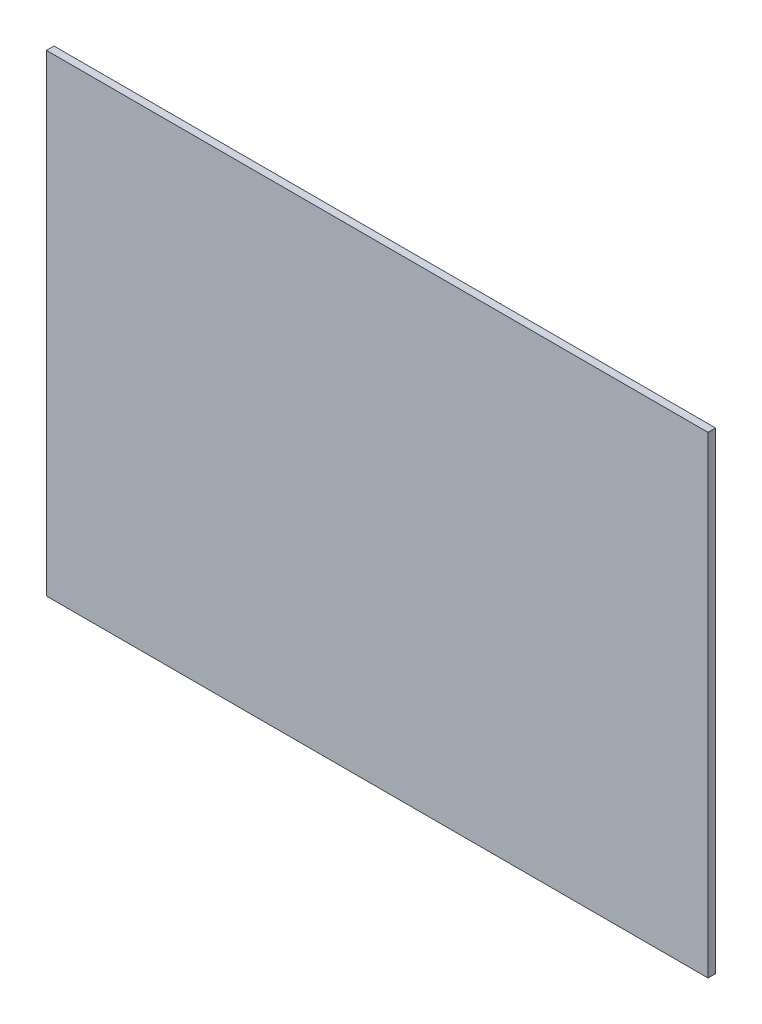
ISO-10303-21;
HEADER;
FILE_DESCRIPTION(('STEP AP214'),'2;1');
FILE_NAME('part.step','',(''),(''),'','','');
FILE_SCHEMA(('AUTOMOTIVE_DESIGN { 1 0 10303 214 1 1 1 1 }'));
ENDSEC;
DATA;
#1=APPLICATION_CONTEXT('core data for automotive mechanical design processes');
#2=APPLICATION_PROTOCOL_DEFINITION('international standard','automotive_design',2000,#1);
#3=PRODUCT_CONTEXT('',#1,'mechanical');
#4=PRODUCT('Part','Part','',(#3));
#5=PRODUCT_RELATED_PRODUCT_CATEGORY('part','',(#4));
#6=PRODUCT_DEFINITION_FORMATION('','',#4);
#7=PRODUCT_DEFINITION_CONTEXT('part definition',#1,'design');
#8=PRODUCT_DEFINITION('design','',#6,#7);
#9=PRODUCT_DEFINITION_SHAPE('','',#8);
#10=(LENGTH_UNIT() NAMED_UNIT(*) SI_UNIT(.MILLI.,.METRE.));
#11=(NAMED_UNIT(*) PLANE_ANGLE_UNIT() SI_UNIT($,.RADIAN.));
#12=(NAMED_UNIT(*) SI_UNIT($,.STERADIAN.) SOLID_ANGLE_UNIT());
#13=UNCERTAINTY_MEASURE_WITH_UNIT(LENGTH_MEASURE(1.E-05),#10,'distance_accuracy_value','');
#14=(GEOMETRIC_REPRESENTATION_CONTEXT(3) GLOBAL_UNCERTAINTY_ASSIGNED_CONTEXT((#13)) GLOBAL_UNIT_ASSIGNED_CONTEXT((#10,
#11,#12)) REPRESENTATION_CONTEXT('',''));
#15=CARTESIAN_POINT('',(0.,0.,0.));
#16=DIRECTION('',(0.,0.,1.));
#17=DIRECTION('',(1.,0.,0.));
#18=AXIS2_PLACEMENT_3D('',#15,#16,#17);
#19=CARTESIAN_POINT('',(700.,500.,8.));
#20=DIRECTION('',(-1.,0.,0.));
#21=DIRECTION('',(0.,-1.,0.));
#22=AXIS2_PLACEMENT_3D('',#19,#20,#21);
#23=PLANE('',#22);
#24=DIRECTION('',(0.,1.,0.));
#25=VECTOR('',#24,1.);
#26=CARTESIAN_POINT('',(700.,500.,0.));
#27=LINE('',#26,#25);
#28=CARTESIAN_POINT('',(700.,0.,0.));
#29=VERTEX_POINT('',#28);
#30=CARTESIAN_POINT('',(700.,500.,0.));
#31=VERTEX_POINT('',#30);
#32=EDGE_CURVE('E109',#29,#31,#27,.T.);
#33=ORIENTED_EDGE('',*,*,#32,.T.);
#34=DIRECTION('',(0.,0.,-1.));
#35=VECTOR('',#34,1.);
#36=CARTESIAN_POINT('',(700.,500.,8.));
#37=LINE('',#36,#35);
#38=CARTESIAN_POINT('',(700.,500.,8.));
#39=VERTEX_POINT('',#38);
#40=EDGE_CURVE('E11',#39,#31,#37,.T.);
#41=ORIENTED_EDGE('',*,*,#40,.F.);
#42=DIRECTION('',(0.,1.,0.));
#43=VECTOR('',#42,1.);
#44=CARTESIAN_POINT('',(700.,500.,8.));
#45=LINE('',#44,#43);
#46=CARTESIAN_POINT('',(700.,0.,8.));
#47=VERTEX_POINT('',#46);
#48=EDGE_CURVE('E93',#47,#39,#45,.T.);
#49=ORIENTED_EDGE('',*,*,#48,.F.);
#50=DIRECTION('',(0.,0.,-1.));
#51=VECTOR('',#50,1.);
#52=CARTESIAN_POINT('',(700.,0.,8.));
#53=LINE('',#52,#51);
#54=EDGE_CURVE('E105',#47,#29,#53,.T.);
#55=ORIENTED_EDGE('',*,*,#54,.T.);
#56=EDGE_LOOP('',(#33,#41,#49,#55));
#57=FACE_BOUND('',#56,.T.);
#58=ADVANCED_FACE('F41',(#57),#23,.F.);
#59=CARTESIAN_POINT('',(700.,500.,8.));
#60=DIRECTION('',(0.,-1.,0.));
#61=DIRECTION('',(1.,0.,0.));
#62=AXIS2_PLACEMENT_3D('',#59,#60,#61);
#63=PLANE('',#62);
#64=DIRECTION('',(-1.,0.,0.));
#65=VECTOR('',#64,1.);
#66=CARTESIAN_POINT('',(700.,500.,0.));
#67=LINE('',#66,#65);
#68=CARTESIAN_POINT('',(0.,500.,0.));
#69=VERTEX_POINT('',#68);
#70=EDGE_CURVE('E98',#31,#69,#67,.T.);
#71=ORIENTED_EDGE('',*,*,#70,.T.);
#72=DIRECTION('',(0.,0.,-1.));
#73=VECTOR('',#72,1.);
#74=CARTESIAN_POINT('',(0.,500.,8.));
#75=LINE('',#74,#73);
#76=CARTESIAN_POINT('',(0.,500.,8.));
#77=VERTEX_POINT('',#76);
#78=EDGE_CURVE('E50',#77,#69,#75,.T.);
#79=ORIENTED_EDGE('',*,*,#78,.F.);
#80=DIRECTION('',(-1.,0.,0.));
#81=VECTOR('',#80,1.);
#82=CARTESIAN_POINT('',(700.,500.,8.));
#83=LINE('',#82,#81);
#84=EDGE_CURVE('E88',#39,#77,#83,.T.);
#85=ORIENTED_EDGE('',*,*,#84,.F.);
#86=ORIENTED_EDGE('',*,*,#40,.T.);
#87=EDGE_LOOP('',(#71,#79,#85,#86));
#88=FACE_BOUND('',#87,.T.);
#89=ADVANCED_FACE('F97',(#88),#63,.F.);
#90=CARTESIAN_POINT('',(0.,500.,8.));
#91=DIRECTION('',(1.,0.,0.));
#92=DIRECTION('',(0.,1.,0.));
#93=AXIS2_PLACEMENT_3D('',#90,#91,#92);
#94=PLANE('',#93);
#95=DIRECTION('',(0.,-1.,0.));
#96=VECTOR('',#95,1.);
#97=CARTESIAN_POINT('',(0.,500.,0.));
#98=LINE('',#97,#96);
#99=CARTESIAN_POINT('',(0.,0.,0.));
#100=VERTEX_POINT('',#99);
#101=EDGE_CURVE('E75',#69,#100,#98,.T.);
#102=ORIENTED_EDGE('',*,*,#101,.T.);
#103=DIRECTION('',(0.,0.,-1.));
#104=VECTOR('',#103,1.);
#105=CARTESIAN_POINT('',(0.,0.,8.));
#106=LINE('',#105,#104);
#107=CARTESIAN_POINT('',(0.,0.,8.));
#108=VERTEX_POINT('',#107);
#109=EDGE_CURVE('E100',#108,#100,#106,.T.);
#110=ORIENTED_EDGE('',*,*,#109,.F.);
#111=DIRECTION('',(0.,-1.,0.));
#112=VECTOR('',#111,1.);
#113=CARTESIAN_POINT('',(0.,500.,8.));
#114=LINE('',#113,#112);
#115=EDGE_CURVE('E91',#77,#108,#114,.T.);
#116=ORIENTED_EDGE('',*,*,#115,.F.);
#117=ORIENTED_EDGE('',*,*,#78,.T.);
#118=EDGE_LOOP('',(#102,#110,#116,#117));
#119=FACE_BOUND('',#118,.T.);
#120=ADVANCED_FACE('F101',(#119),#94,.F.);
#121=CARTESIAN_POINT('',(700.,0.,8.));
#122=DIRECTION('',(0.,1.,0.));
#123=DIRECTION('',(-1.,0.,0.));
#124=AXIS2_PLACEMENT_3D('',#121,#122,#123);
#125=PLANE('',#124);
#126=DIRECTION('',(1.,0.,0.));
#127=VECTOR('',#126,1.);
#128=CARTESIAN_POINT('',(700.,0.,0.));
#129=LINE('',#128,#127);
#130=EDGE_CURVE('E81',#100,#29,#129,.T.);
#131=ORIENTED_EDGE('',*,*,#130,.T.);
#132=ORIENTED_EDGE('',*,*,#54,.F.);
#133=DIRECTION('',(1.,0.,0.));
#134=VECTOR('',#133,1.);
#135=CARTESIAN_POINT('',(700.,0.,8.));
#136=LINE('',#135,#134);
#137=EDGE_CURVE('E58',#108,#47,#136,.T.);
#138=ORIENTED_EDGE('',*,*,#137,.F.);
#139=ORIENTED_EDGE('',*,*,#109,.T.);
#140=EDGE_LOOP('',(#131,#132,#138,#139));
#141=FACE_BOUND('',#140,.T.);
#142=ADVANCED_FACE('F122',(#141),#125,.F.);
#143=CARTESIAN_POINT('',(0.,0.,8.));
#144=DIRECTION('',(0.,0.,-1.));
#145=DIRECTION('',(-1.,0.,0.));
#146=AXIS2_PLACEMENT_3D('',#143,#144,#145);
#147=PLANE('',#146);
#148=ORIENTED_EDGE('',*,*,#48,.T.);
#149=ORIENTED_EDGE('',*,*,#84,.T.);
#150=ORIENTED_EDGE('',*,*,#115,.T.);
#151=ORIENTED_EDGE('',*,*,#137,.T.);
#152=EDGE_LOOP('',(#148,#149,#150,#151));
#153=FACE_BOUND('',#152,.T.);
#154=ADVANCED_FACE('F89',(#153),#147,.F.);
#155=CARTESIAN_POINT('',(0.,0.,0.));
#156=DIRECTION('',(0.,0.,-1.));
#157=DIRECTION('',(-1.,0.,0.));
#158=AXIS2_PLACEMENT_3D('',#155,#156,#157);
#159=PLANE('',#158);
#160=ORIENTED_EDGE('',*,*,#32,.F.);
#161=ORIENTED_EDGE('',*,*,#130,.F.);
#162=ORIENTED_EDGE('',*,*,#101,.F.);
#163=ORIENTED_EDGE('',*,*,#70,.F.);
#164=EDGE_LOOP('',(#160,#161,#162,#163));
#165=FACE_BOUND('',#164,.T.);
#166=ADVANCED_FACE('F125',(#165),#159,.T.);
#167=CLOSED_SHELL('',(#58,#89,#120,#142,#154,#166));
#168=MANIFOLD_SOLID_BREP('B2',#167);
#169=ADVANCED_BREP_SHAPE_REPRESENTATION('',(#18,#168),#14);
#170=SHAPE_DEFINITION_REPRESENTATION(#9,#169);
ENDSEC;
END-ISO-10303-21;
